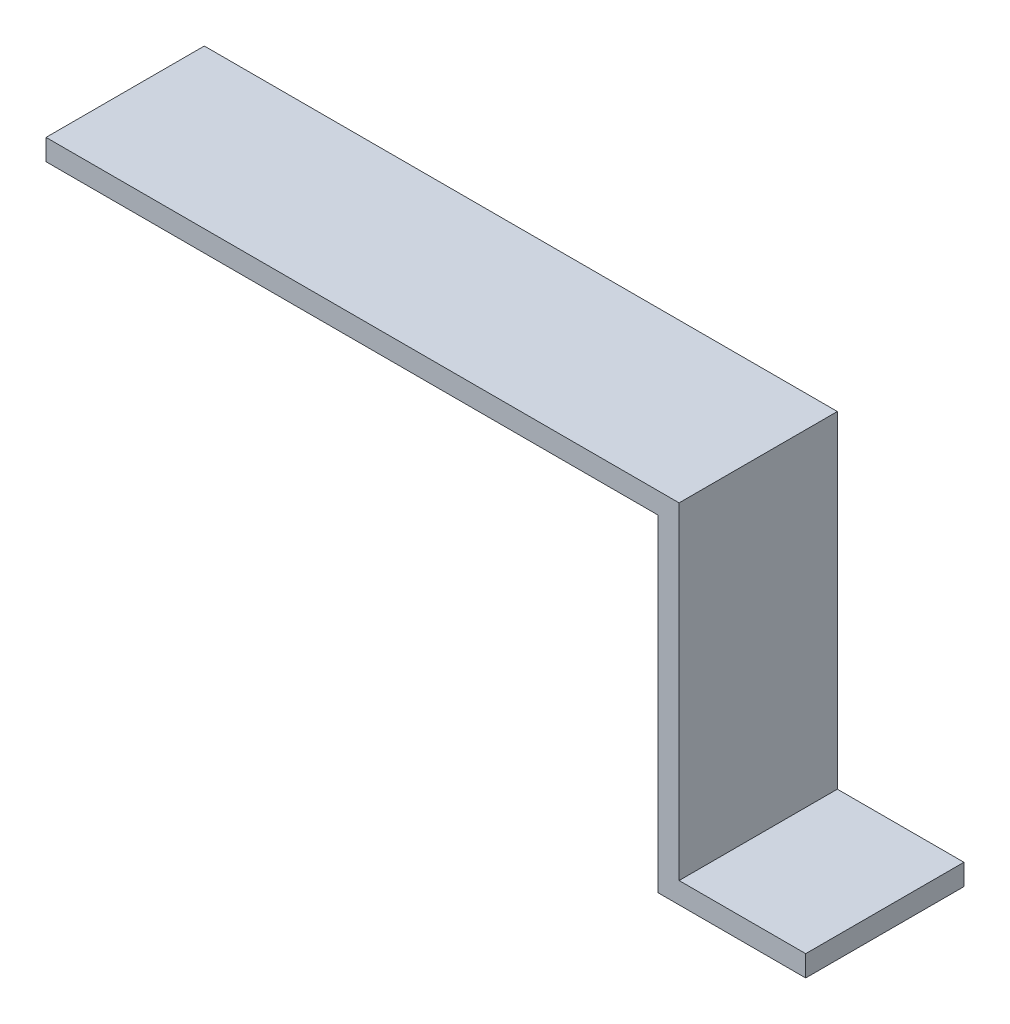
ISO-10303-21;
HEADER;
FILE_DESCRIPTION(('STEP AP214'),'2;1');
FILE_NAME('part.step','',(''),(''),'','','');
FILE_SCHEMA(('AUTOMOTIVE_DESIGN { 1 0 10303 214 1 1 1 1 }'));
ENDSEC;
DATA;
#1=APPLICATION_CONTEXT('core data for automotive mechanical design processes');
#2=APPLICATION_PROTOCOL_DEFINITION('international standard','automotive_design',2000,#1);
#3=PRODUCT_CONTEXT('',#1,'mechanical');
#4=PRODUCT('Part','Part','',(#3));
#5=PRODUCT_RELATED_PRODUCT_CATEGORY('part','',(#4));
#6=PRODUCT_DEFINITION_FORMATION('','',#4);
#7=PRODUCT_DEFINITION_CONTEXT('part definition',#1,'design');
#8=PRODUCT_DEFINITION('design','',#6,#7);
#9=PRODUCT_DEFINITION_SHAPE('','',#8);
#10=(LENGTH_UNIT() NAMED_UNIT(*) SI_UNIT(.MILLI.,.METRE.));
#11=(NAMED_UNIT(*) PLANE_ANGLE_UNIT() SI_UNIT($,.RADIAN.));
#12=(NAMED_UNIT(*) SI_UNIT($,.STERADIAN.) SOLID_ANGLE_UNIT());
#13=UNCERTAINTY_MEASURE_WITH_UNIT(LENGTH_MEASURE(1.E-05),#10,'distance_accuracy_value','');
#14=(GEOMETRIC_REPRESENTATION_CONTEXT(3) GLOBAL_UNCERTAINTY_ASSIGNED_CONTEXT((#13)) GLOBAL_UNIT_ASSIGNED_CONTEXT((#10,
#11,#12)) REPRESENTATION_CONTEXT('',''));
#15=CARTESIAN_POINT('',(0.,0.,0.));
#16=DIRECTION('',(0.,0.,1.));
#17=DIRECTION('',(1.,0.,0.));
#18=AXIS2_PLACEMENT_3D('',#15,#16,#17);
#19=CARTESIAN_POINT('',(0.,-2.,15.));
#20=DIRECTION('',(1.,0.,0.));
#21=DIRECTION('',(0.,0.,-1.));
#22=AXIS2_PLACEMENT_3D('',#19,#20,#21);
#23=PLANE('',#22);
#24=DIRECTION('',(0.,-1.,0.));
#25=VECTOR('',#24,1.);
#26=CARTESIAN_POINT('',(0.,-2.,0.));
#27=LINE('',#26,#25);
#28=CARTESIAN_POINT('',(0.,0.,0.));
#29=VERTEX_POINT('',#28);
#30=CARTESIAN_POINT('',(0.,-2.,0.));
#31=VERTEX_POINT('',#30);
#32=EDGE_CURVE('E140',#29,#31,#27,.T.);
#33=ORIENTED_EDGE('',*,*,#32,.T.);
#34=DIRECTION('',(0.,0.,-1.));
#35=VECTOR('',#34,1.);
#36=CARTESIAN_POINT('',(0.,-2.,15.));
#37=LINE('',#36,#35);
#38=CARTESIAN_POINT('',(0.,-2.,15.));
#39=VERTEX_POINT('',#38);
#40=EDGE_CURVE('E11',#39,#31,#37,.T.);
#41=ORIENTED_EDGE('',*,*,#40,.F.);
#42=DIRECTION('',(0.,-1.,0.));
#43=VECTOR('',#42,1.);
#44=CARTESIAN_POINT('',(0.,-2.,15.));
#45=LINE('',#44,#43);
#46=CARTESIAN_POINT('',(0.,0.,15.));
#47=VERTEX_POINT('',#46);
#48=EDGE_CURVE('E161',#47,#39,#45,.T.);
#49=ORIENTED_EDGE('',*,*,#48,.F.);
#50=DIRECTION('',(0.,0.,-1.));
#51=VECTOR('',#50,1.);
#52=CARTESIAN_POINT('',(0.,0.,15.));
#53=LINE('',#52,#51);
#54=EDGE_CURVE('E136',#47,#29,#53,.T.);
#55=ORIENTED_EDGE('',*,*,#54,.T.);
#56=EDGE_LOOP('',(#33,#41,#49,#55));
#57=FACE_BOUND('',#56,.T.);
#58=ADVANCED_FACE('F38',(#57),#23,.F.);
#59=CARTESIAN_POINT('',(58.,-1.99999999999999,15.));
#60=DIRECTION('',(0.,1.,0.));
#61=DIRECTION('',(-1.,0.,0.));
#62=AXIS2_PLACEMENT_3D('',#59,#60,#61);
#63=PLANE('',#62);
#64=DIRECTION('',(1.,0.,0.));
#65=VECTOR('',#64,1.);
#66=CARTESIAN_POINT('',(58.,-1.99999999999999,0.));
#67=LINE('',#66,#65);
#68=CARTESIAN_POINT('',(58.,-1.99999999999999,0.));
#69=VERTEX_POINT('',#68);
#70=EDGE_CURVE('E144',#31,#69,#67,.T.);
#71=ORIENTED_EDGE('',*,*,#70,.T.);
#72=DIRECTION('',(0.,0.,-1.));
#73=VECTOR('',#72,1.);
#74=CARTESIAN_POINT('',(58.,-1.99999999999999,15.));
#75=LINE('',#74,#73);
#76=CARTESIAN_POINT('',(58.,-1.99999999999999,15.));
#77=VERTEX_POINT('',#76);
#78=EDGE_CURVE('E46',#77,#69,#75,.T.);
#79=ORIENTED_EDGE('',*,*,#78,.F.);
#80=DIRECTION('',(1.,0.,0.));
#81=VECTOR('',#80,1.);
#82=CARTESIAN_POINT('',(58.,-1.99999999999999,15.));
#83=LINE('',#82,#81);
#84=EDGE_CURVE('E97',#39,#77,#83,.T.);
#85=ORIENTED_EDGE('',*,*,#84,.F.);
#86=ORIENTED_EDGE('',*,*,#40,.T.);
#87=EDGE_LOOP('',(#71,#79,#85,#86));
#88=FACE_BOUND('',#87,.T.);
#89=ADVANCED_FACE('F207',(#88),#63,.F.);
#90=CARTESIAN_POINT('',(58.,-33.,15.));
#91=DIRECTION('',(1.,0.,0.));
#92=DIRECTION('',(0.,1.,0.));
#93=AXIS2_PLACEMENT_3D('',#90,#91,#92);
#94=PLANE('',#93);
#95=DIRECTION('',(0.,-1.,0.));
#96=VECTOR('',#95,1.);
#97=CARTESIAN_POINT('',(58.,-33.,0.));
#98=LINE('',#97,#96);
#99=CARTESIAN_POINT('',(58.,-33.,0.));
#100=VERTEX_POINT('',#99);
#101=EDGE_CURVE('E147',#69,#100,#98,.T.);
#102=ORIENTED_EDGE('',*,*,#101,.T.);
#103=DIRECTION('',(0.,0.,-1.));
#104=VECTOR('',#103,1.);
#105=CARTESIAN_POINT('',(58.,-33.,15.));
#106=LINE('',#105,#104);
#107=CARTESIAN_POINT('',(58.,-33.,15.));
#108=VERTEX_POINT('',#107);
#109=EDGE_CURVE('E129',#108,#100,#106,.T.);
#110=ORIENTED_EDGE('',*,*,#109,.F.);
#111=DIRECTION('',(0.,-1.,0.));
#112=VECTOR('',#111,1.);
#113=CARTESIAN_POINT('',(58.,-33.,15.));
#114=LINE('',#113,#112);
#115=EDGE_CURVE('E175',#77,#108,#114,.T.);
#116=ORIENTED_EDGE('',*,*,#115,.F.);
#117=ORIENTED_EDGE('',*,*,#78,.T.);
#118=EDGE_LOOP('',(#102,#110,#116,#117));
#119=FACE_BOUND('',#118,.T.);
#120=ADVANCED_FACE('F173',(#119),#94,.F.);
#121=CARTESIAN_POINT('',(84.2396089702769,-33.,15.));
#122=DIRECTION('',(0.,1.,0.));
#123=DIRECTION('',(0.,0.,1.));
#124=AXIS2_PLACEMENT_3D('',#121,#122,#123);
#125=PLANE('',#124);
#126=DIRECTION('',(1.,0.,0.));
#127=VECTOR('',#126,1.);
#128=CARTESIAN_POINT('',(84.2396089702769,-33.,0.));
#129=LINE('',#128,#127);
#130=CARTESIAN_POINT('',(71.9996089702769,-33.,0.));
#131=VERTEX_POINT('',#130);
#132=EDGE_CURVE('E150',#100,#131,#129,.T.);
#133=ORIENTED_EDGE('',*,*,#132,.T.);
#134=DIRECTION('',(0.,0.,1.));
#135=VECTOR('',#134,1.);
#136=CARTESIAN_POINT('',(71.9996089702769,-33.,15.));
#137=LINE('',#136,#135);
#138=CARTESIAN_POINT('',(71.9996089702769,-33.,15.));
#139=VERTEX_POINT('',#138);
#140=EDGE_CURVE('E53',#131,#139,#137,.T.);
#141=ORIENTED_EDGE('',*,*,#140,.T.);
#142=DIRECTION('',(1.,0.,0.));
#143=VECTOR('',#142,1.);
#144=CARTESIAN_POINT('',(84.2396089702769,-33.,15.));
#145=LINE('',#144,#143);
#146=EDGE_CURVE('E119',#108,#139,#145,.T.);
#147=ORIENTED_EDGE('',*,*,#146,.F.);
#148=ORIENTED_EDGE('',*,*,#109,.T.);
#149=EDGE_LOOP('',(#133,#141,#147,#148));
#150=FACE_BOUND('',#149,.T.);
#151=ADVANCED_FACE('F182',(#150),#125,.F.);
#152=CARTESIAN_POINT('',(60.,-31.,15.));
#153=DIRECTION('',(0.,-1.,0.));
#154=DIRECTION('',(0.,0.,-1.));
#155=AXIS2_PLACEMENT_3D('',#152,#153,#154);
#156=PLANE('',#155);
#157=DIRECTION('',(-1.,0.,0.));
#158=VECTOR('',#157,1.);
#159=CARTESIAN_POINT('',(60.,-31.,15.));
#160=LINE('',#159,#158);
#161=CARTESIAN_POINT('',(71.9996089702769,-31.,15.));
#162=VERTEX_POINT('',#161);
#163=CARTESIAN_POINT('',(60.,-31.,15.));
#164=VERTEX_POINT('',#163);
#165=EDGE_CURVE('E108',#162,#164,#160,.T.);
#166=ORIENTED_EDGE('',*,*,#165,.F.);
#167=DIRECTION('',(0.,0.,1.));
#168=VECTOR('',#167,1.);
#169=CARTESIAN_POINT('',(71.9996089702769,-31.,15.));
#170=LINE('',#169,#168);
#171=CARTESIAN_POINT('',(71.9996089702769,-31.,0.));
#172=VERTEX_POINT('',#171);
#173=EDGE_CURVE('E196',#172,#162,#170,.T.);
#174=ORIENTED_EDGE('',*,*,#173,.F.);
#175=DIRECTION('',(-1.,0.,0.));
#176=VECTOR('',#175,1.);
#177=CARTESIAN_POINT('',(60.,-31.,0.));
#178=LINE('',#177,#176);
#179=CARTESIAN_POINT('',(60.,-31.,0.));
#180=VERTEX_POINT('',#179);
#181=EDGE_CURVE('E125',#172,#180,#178,.T.);
#182=ORIENTED_EDGE('',*,*,#181,.T.);
#183=DIRECTION('',(0.,0.,-1.));
#184=VECTOR('',#183,1.);
#185=CARTESIAN_POINT('',(60.,-31.,15.));
#186=LINE('',#185,#184);
#187=EDGE_CURVE('E122',#164,#180,#186,.T.);
#188=ORIENTED_EDGE('',*,*,#187,.F.);
#189=EDGE_LOOP('',(#166,#174,#182,#188));
#190=FACE_BOUND('',#189,.T.);
#191=ADVANCED_FACE('F123',(#190),#156,.F.);
#192=CARTESIAN_POINT('',(60.,0.,15.));
#193=DIRECTION('',(-1.,0.,0.));
#194=DIRECTION('',(0.,-1.,0.));
#195=AXIS2_PLACEMENT_3D('',#192,#193,#194);
#196=PLANE('',#195);
#197=DIRECTION('',(0.,1.,0.));
#198=VECTOR('',#197,1.);
#199=CARTESIAN_POINT('',(60.,0.,0.));
#200=LINE('',#199,#198);
#201=CARTESIAN_POINT('',(60.,0.,0.));
#202=VERTEX_POINT('',#201);
#203=EDGE_CURVE('E156',#180,#202,#200,.T.);
#204=ORIENTED_EDGE('',*,*,#203,.T.);
#205=DIRECTION('',(0.,0.,-1.));
#206=VECTOR('',#205,1.);
#207=CARTESIAN_POINT('',(60.,0.,15.));
#208=LINE('',#207,#206);
#209=CARTESIAN_POINT('',(60.,0.,15.));
#210=VERTEX_POINT('',#209);
#211=EDGE_CURVE('E130',#210,#202,#208,.T.);
#212=ORIENTED_EDGE('',*,*,#211,.F.);
#213=DIRECTION('',(0.,1.,0.));
#214=VECTOR('',#213,1.);
#215=CARTESIAN_POINT('',(60.,0.,15.));
#216=LINE('',#215,#214);
#217=EDGE_CURVE('E113',#164,#210,#216,.T.);
#218=ORIENTED_EDGE('',*,*,#217,.F.);
#219=ORIENTED_EDGE('',*,*,#187,.T.);
#220=EDGE_LOOP('',(#204,#212,#218,#219));
#221=FACE_BOUND('',#220,.T.);
#222=ADVANCED_FACE('F132',(#221),#196,.F.);
#223=CARTESIAN_POINT('',(0.,0.,15.));
#224=DIRECTION('',(0.,-1.,0.));
#225=DIRECTION('',(0.,0.,-1.));
#226=AXIS2_PLACEMENT_3D('',#223,#224,#225);
#227=PLANE('',#226);
#228=DIRECTION('',(-1.,0.,0.));
#229=VECTOR('',#228,1.);
#230=CARTESIAN_POINT('',(0.,0.,0.));
#231=LINE('',#230,#229);
#232=EDGE_CURVE('E89',#202,#29,#231,.T.);
#233=ORIENTED_EDGE('',*,*,#232,.T.);
#234=ORIENTED_EDGE('',*,*,#54,.F.);
#235=DIRECTION('',(-1.,0.,0.));
#236=VECTOR('',#235,1.);
#237=CARTESIAN_POINT('',(0.,0.,15.));
#238=LINE('',#237,#236);
#239=EDGE_CURVE('E62',#210,#47,#238,.T.);
#240=ORIENTED_EDGE('',*,*,#239,.F.);
#241=ORIENTED_EDGE('',*,*,#211,.T.);
#242=EDGE_LOOP('',(#233,#234,#240,#241));
#243=FACE_BOUND('',#242,.T.);
#244=ADVANCED_FACE('F203',(#243),#227,.F.);
#245=CARTESIAN_POINT('',(0.,0.,15.));
#246=DIRECTION('',(0.,0.,-1.));
#247=DIRECTION('',(-1.,0.,0.));
#248=AXIS2_PLACEMENT_3D('',#245,#246,#247);
#249=PLANE('',#248);
#250=ORIENTED_EDGE('',*,*,#146,.T.);
#251=DIRECTION('',(0.,1.,0.));
#252=VECTOR('',#251,1.);
#253=CARTESIAN_POINT('',(71.9996089702769,-33.,15.));
#254=LINE('',#253,#252);
#255=EDGE_CURVE('E115',#139,#162,#254,.T.);
#256=ORIENTED_EDGE('',*,*,#255,.T.);
#257=ORIENTED_EDGE('',*,*,#165,.T.);
#258=ORIENTED_EDGE('',*,*,#217,.T.);
#259=ORIENTED_EDGE('',*,*,#239,.T.);
#260=ORIENTED_EDGE('',*,*,#48,.T.);
#261=ORIENTED_EDGE('',*,*,#84,.T.);
#262=ORIENTED_EDGE('',*,*,#115,.T.);
#263=EDGE_LOOP('',(#250,#256,#257,#258,#259,#260,#261,#262));
#264=FACE_BOUND('',#263,.T.);
#265=ADVANCED_FACE('F111',(#264),#249,.F.);
#266=CARTESIAN_POINT('',(0.,0.,0.));
#267=DIRECTION('',(0.,0.,-1.));
#268=DIRECTION('',(-1.,0.,0.));
#269=AXIS2_PLACEMENT_3D('',#266,#267,#268);
#270=PLANE('',#269);
#271=DIRECTION('',(0.,1.,0.));
#272=VECTOR('',#271,1.);
#273=CARTESIAN_POINT('',(71.9996089702769,-33.,0.));
#274=LINE('',#273,#272);
#275=EDGE_CURVE('E180',#131,#172,#274,.T.);
#276=ORIENTED_EDGE('',*,*,#275,.F.);
#277=ORIENTED_EDGE('',*,*,#132,.F.);
#278=ORIENTED_EDGE('',*,*,#101,.F.);
#279=ORIENTED_EDGE('',*,*,#70,.F.);
#280=ORIENTED_EDGE('',*,*,#32,.F.);
#281=ORIENTED_EDGE('',*,*,#232,.F.);
#282=ORIENTED_EDGE('',*,*,#203,.F.);
#283=ORIENTED_EDGE('',*,*,#181,.F.);
#284=EDGE_LOOP('',(#276,#277,#278,#279,#280,#281,#282,#283));
#285=FACE_BOUND('',#284,.T.);
#286=ADVANCED_FACE('F178',(#285),#270,.T.);
#287=CARTESIAN_POINT('',(71.9996089702769,-33.,15.));
#288=DIRECTION('',(-1.,0.,0.));
#289=DIRECTION('',(0.,0.,1.));
#290=AXIS2_PLACEMENT_3D('',#287,#288,#289);
#291=PLANE('',#290);
#292=ORIENTED_EDGE('',*,*,#173,.T.);
#293=ORIENTED_EDGE('',*,*,#255,.F.);
#294=ORIENTED_EDGE('',*,*,#140,.F.);
#295=ORIENTED_EDGE('',*,*,#275,.T.);
#296=EDGE_LOOP('',(#292,#293,#294,#295));
#297=FACE_BOUND('',#296,.T.);
#298=ADVANCED_FACE('F201',(#297),#291,.F.);
#299=CLOSED_SHELL('',(#58,#89,#120,#151,#191,#222,#244,#265,#286,#298));
#300=MANIFOLD_SOLID_BREP('B2',#299);
#301=ADVANCED_BREP_SHAPE_REPRESENTATION('',(#18,#300),#14);
#302=SHAPE_DEFINITION_REPRESENTATION(#9,#301);
ENDSEC;
END-ISO-10303-21;
